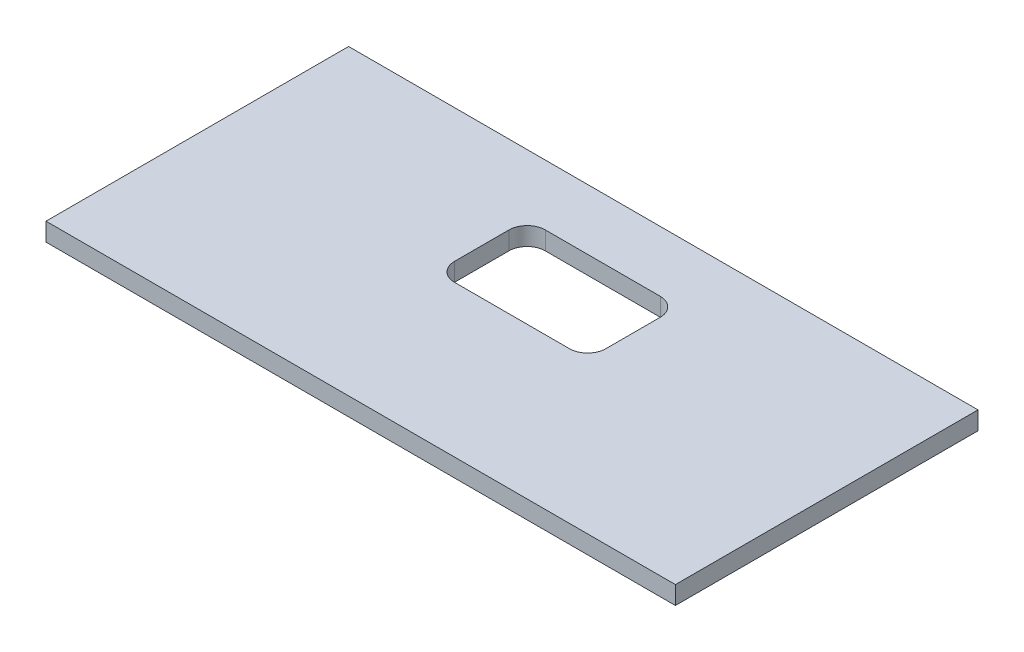
ISO-10303-21;
HEADER;
FILE_DESCRIPTION(('STEP AP214'),'2;1');
FILE_NAME('part.step','',(''),(''),'','','');
FILE_SCHEMA(('AUTOMOTIVE_DESIGN { 1 0 10303 214 1 1 1 1 }'));
ENDSEC;
DATA;
#1=APPLICATION_CONTEXT('core data for automotive mechanical design processes');
#2=APPLICATION_PROTOCOL_DEFINITION('international standard','automotive_design',2000,#1);
#3=PRODUCT_CONTEXT('',#1,'mechanical');
#4=PRODUCT('Part','Part','',(#3));
#5=PRODUCT_RELATED_PRODUCT_CATEGORY('part','',(#4));
#6=PRODUCT_DEFINITION_FORMATION('','',#4);
#7=PRODUCT_DEFINITION_CONTEXT('part definition',#1,'design');
#8=PRODUCT_DEFINITION('design','',#6,#7);
#9=PRODUCT_DEFINITION_SHAPE('','',#8);
#10=(LENGTH_UNIT() NAMED_UNIT(*) SI_UNIT(.MILLI.,.METRE.));
#11=(NAMED_UNIT(*) PLANE_ANGLE_UNIT() SI_UNIT($,.RADIAN.));
#12=(NAMED_UNIT(*) SI_UNIT($,.STERADIAN.) SOLID_ANGLE_UNIT());
#13=UNCERTAINTY_MEASURE_WITH_UNIT(LENGTH_MEASURE(1.E-05),#10,'distance_accuracy_value','');
#14=(GEOMETRIC_REPRESENTATION_CONTEXT(3) GLOBAL_UNCERTAINTY_ASSIGNED_CONTEXT((#13)) GLOBAL_UNIT_ASSIGNED_CONTEXT((#10,
#11,#12)) REPRESENTATION_CONTEXT('',''));
#15=CARTESIAN_POINT('',(0.,0.,0.));
#16=DIRECTION('',(0.,0.,1.));
#17=DIRECTION('',(1.,0.,0.));
#18=AXIS2_PLACEMENT_3D('',#15,#16,#17);
#19=CARTESIAN_POINT('',(0.,3.,0.));
#20=DIRECTION('',(0.,1.,0.));
#21=DIRECTION('',(0.,0.,1.));
#22=AXIS2_PLACEMENT_3D('',#19,#20,#21);
#23=PLANE('',#22);
#24=DIRECTION('',(0.,0.,1.));
#25=VECTOR('',#24,1.);
#26=CARTESIAN_POINT('',(0.,3.,0.));
#27=LINE('',#26,#25);
#28=CARTESIAN_POINT('',(0.,3.,0.));
#29=VERTEX_POINT('',#28);
#30=CARTESIAN_POINT('',(0.,3.,50.));
#31=VERTEX_POINT('',#30);
#32=EDGE_CURVE('E218',#29,#31,#27,.T.);
#33=ORIENTED_EDGE('',*,*,#32,.T.);
#34=DIRECTION('',(1.,0.,0.));
#35=VECTOR('',#34,1.);
#36=CARTESIAN_POINT('',(0.,3.,50.));
#37=LINE('',#36,#35);
#38=CARTESIAN_POINT('',(104.,3.,50.));
#39=VERTEX_POINT('',#38);
#40=EDGE_CURVE('E222',#31,#39,#37,.T.);
#41=ORIENTED_EDGE('',*,*,#40,.T.);
#42=DIRECTION('',(0.,0.,-1.));
#43=VECTOR('',#42,1.);
#44=CARTESIAN_POINT('',(104.,3.,0.));
#45=LINE('',#44,#43);
#46=CARTESIAN_POINT('',(104.,3.,0.));
#47=VERTEX_POINT('',#46);
#48=EDGE_CURVE('E226',#39,#47,#45,.T.);
#49=ORIENTED_EDGE('',*,*,#48,.T.);
#50=DIRECTION('',(-1.,0.,0.));
#51=VECTOR('',#50,1.);
#52=CARTESIAN_POINT('',(0.,3.,0.));
#53=LINE('',#52,#51);
#54=EDGE_CURVE('E229',#47,#29,#53,.T.);
#55=ORIENTED_EDGE('',*,*,#54,.T.);
#56=EDGE_LOOP('',(#33,#41,#49,#55));
#57=FACE_BOUND('',#56,.T.);
#58=DIRECTION('',(-1.,0.,0.));
#59=VECTOR('',#58,1.);
#60=CARTESIAN_POINT('',(42.5,3.,10.));
#61=LINE('',#60,#59);
#62=CARTESIAN_POINT('',(61.5,3.,10.));
#63=VERTEX_POINT('',#62);
#64=CARTESIAN_POINT('',(42.5,3.,10.));
#65=VERTEX_POINT('',#64);
#66=EDGE_CURVE('E138',#63,#65,#61,.T.);
#67=ORIENTED_EDGE('',*,*,#66,.F.);
#68=CARTESIAN_POINT('',(61.5,3.,13.));
#69=DIRECTION('',(0.,1.,0.));
#70=DIRECTION('',(0.,0.,-1.));
#71=AXIS2_PLACEMENT_3D('',#68,#69,#70);
#72=CIRCLE('',#71,3.);
#73=CARTESIAN_POINT('',(64.5,3.,13.));
#74=VERTEX_POINT('',#73);
#75=EDGE_CURVE('E129',#74,#63,#72,.T.);
#76=ORIENTED_EDGE('',*,*,#75,.F.);
#77=DIRECTION('',(0.,0.,-1.));
#78=VECTOR('',#77,1.);
#79=CARTESIAN_POINT('',(64.5,3.,13.));
#80=LINE('',#79,#78);
#81=CARTESIAN_POINT('',(64.5,3.,22.));
#82=VERTEX_POINT('',#81);
#83=EDGE_CURVE('E170',#82,#74,#80,.T.);
#84=ORIENTED_EDGE('',*,*,#83,.F.);
#85=CARTESIAN_POINT('',(61.5,3.,22.));
#86=DIRECTION('',(0.,1.,0.));
#87=DIRECTION('',(0.,0.,1.));
#88=AXIS2_PLACEMENT_3D('',#85,#86,#87);
#89=CIRCLE('',#88,3.);
#90=CARTESIAN_POINT('',(61.5,3.,25.));
#91=VERTEX_POINT('',#90);
#92=EDGE_CURVE('E167',#91,#82,#89,.T.);
#93=ORIENTED_EDGE('',*,*,#92,.F.);
#94=DIRECTION('',(1.,0.,0.));
#95=VECTOR('',#94,1.);
#96=CARTESIAN_POINT('',(42.5,3.,25.));
#97=LINE('',#96,#95);
#98=CARTESIAN_POINT('',(42.5,3.,25.));
#99=VERTEX_POINT('',#98);
#100=EDGE_CURVE('E164',#99,#91,#97,.T.);
#101=ORIENTED_EDGE('',*,*,#100,.F.);
#102=CARTESIAN_POINT('',(42.5,3.,22.));
#103=DIRECTION('',(0.,1.,0.));
#104=DIRECTION('',(0.,0.,1.));
#105=AXIS2_PLACEMENT_3D('',#102,#103,#104);
#106=CIRCLE('',#105,3.);
#107=CARTESIAN_POINT('',(39.5,3.,22.));
#108=VERTEX_POINT('',#107);
#109=EDGE_CURVE('E161',#108,#99,#106,.T.);
#110=ORIENTED_EDGE('',*,*,#109,.F.);
#111=DIRECTION('',(0.,0.,1.));
#112=VECTOR('',#111,1.);
#113=CARTESIAN_POINT('',(39.5,3.,13.));
#114=LINE('',#113,#112);
#115=CARTESIAN_POINT('',(39.5,3.,13.));
#116=VERTEX_POINT('',#115);
#117=EDGE_CURVE('E156',#116,#108,#114,.T.);
#118=ORIENTED_EDGE('',*,*,#117,.F.);
#119=CARTESIAN_POINT('',(42.5,3.,13.));
#120=DIRECTION('',(0.,1.,0.));
#121=DIRECTION('',(0.,0.,1.));
#122=AXIS2_PLACEMENT_3D('',#119,#120,#121);
#123=CIRCLE('',#122,3.);
#124=EDGE_CURVE('E152',#65,#116,#123,.T.);
#125=ORIENTED_EDGE('',*,*,#124,.F.);
#126=EDGE_LOOP('',(#67,#76,#84,#93,#101,#110,#118,#125));
#127=FACE_BOUND('',#126,.T.);
#128=ADVANCED_FACE('F39',(#57,#127),#23,.T.);
#129=CARTESIAN_POINT('',(0.,0.,0.));
#130=DIRECTION('',(0.,1.,0.));
#131=DIRECTION('',(0.,0.,1.));
#132=AXIS2_PLACEMENT_3D('',#129,#130,#131);
#133=PLANE('',#132);
#134=DIRECTION('',(0.,0.,1.));
#135=VECTOR('',#134,1.);
#136=CARTESIAN_POINT('',(0.,0.,0.));
#137=LINE('',#136,#135);
#138=CARTESIAN_POINT('',(0.,0.,0.));
#139=VERTEX_POINT('',#138);
#140=CARTESIAN_POINT('',(0.,0.,50.));
#141=VERTEX_POINT('',#140);
#142=EDGE_CURVE('E147',#139,#141,#137,.T.);
#143=ORIENTED_EDGE('',*,*,#142,.F.);
#144=DIRECTION('',(-1.,0.,0.));
#145=VECTOR('',#144,1.);
#146=CARTESIAN_POINT('',(0.,0.,0.));
#147=LINE('',#146,#145);
#148=CARTESIAN_POINT('',(104.,0.,0.));
#149=VERTEX_POINT('',#148);
#150=EDGE_CURVE('E223',#149,#139,#147,.T.);
#151=ORIENTED_EDGE('',*,*,#150,.F.);
#152=DIRECTION('',(0.,0.,-1.));
#153=VECTOR('',#152,1.);
#154=CARTESIAN_POINT('',(104.,0.,0.));
#155=LINE('',#154,#153);
#156=CARTESIAN_POINT('',(104.,0.,50.));
#157=VERTEX_POINT('',#156);
#158=EDGE_CURVE('E239',#157,#149,#155,.T.);
#159=ORIENTED_EDGE('',*,*,#158,.F.);
#160=DIRECTION('',(1.,0.,0.));
#161=VECTOR('',#160,1.);
#162=CARTESIAN_POINT('',(0.,0.,50.));
#163=LINE('',#162,#161);
#164=EDGE_CURVE('E236',#141,#157,#163,.T.);
#165=ORIENTED_EDGE('',*,*,#164,.F.);
#166=EDGE_LOOP('',(#143,#151,#159,#165));
#167=FACE_BOUND('',#166,.T.);
#168=CARTESIAN_POINT('',(61.5,0.,13.));
#169=DIRECTION('',(0.,1.,0.));
#170=DIRECTION('',(0.,0.,-1.));
#171=AXIS2_PLACEMENT_3D('',#168,#169,#170);
#172=CIRCLE('',#171,3.);
#173=CARTESIAN_POINT('',(64.5,0.,13.));
#174=VERTEX_POINT('',#173);
#175=CARTESIAN_POINT('',(61.5,0.,10.));
#176=VERTEX_POINT('',#175);
#177=EDGE_CURVE('E63',#174,#176,#172,.T.);
#178=ORIENTED_EDGE('',*,*,#177,.T.);
#179=DIRECTION('',(-1.,0.,0.));
#180=VECTOR('',#179,1.);
#181=CARTESIAN_POINT('',(42.5,0.,10.));
#182=LINE('',#181,#180);
#183=CARTESIAN_POINT('',(42.5,0.,10.));
#184=VERTEX_POINT('',#183);
#185=EDGE_CURVE('E145',#176,#184,#182,.T.);
#186=ORIENTED_EDGE('',*,*,#185,.T.);
#187=CARTESIAN_POINT('',(42.5,0.,13.));
#188=DIRECTION('',(0.,1.,0.));
#189=DIRECTION('',(0.,0.,1.));
#190=AXIS2_PLACEMENT_3D('',#187,#188,#189);
#191=CIRCLE('',#190,3.);
#192=CARTESIAN_POINT('',(39.5,0.,13.));
#193=VERTEX_POINT('',#192);
#194=EDGE_CURVE('E177',#184,#193,#191,.T.);
#195=ORIENTED_EDGE('',*,*,#194,.T.);
#196=DIRECTION('',(0.,0.,1.));
#197=VECTOR('',#196,1.);
#198=CARTESIAN_POINT('',(39.5,0.,13.));
#199=LINE('',#198,#197);
#200=CARTESIAN_POINT('',(39.5,0.,22.));
#201=VERTEX_POINT('',#200);
#202=EDGE_CURVE('E181',#193,#201,#199,.T.);
#203=ORIENTED_EDGE('',*,*,#202,.T.);
#204=CARTESIAN_POINT('',(42.5,0.,22.));
#205=DIRECTION('',(0.,1.,0.));
#206=DIRECTION('',(0.,0.,1.));
#207=AXIS2_PLACEMENT_3D('',#204,#205,#206);
#208=CIRCLE('',#207,3.);
#209=CARTESIAN_POINT('',(42.5,0.,25.));
#210=VERTEX_POINT('',#209);
#211=EDGE_CURVE('E185',#201,#210,#208,.T.);
#212=ORIENTED_EDGE('',*,*,#211,.T.);
#213=DIRECTION('',(1.,0.,0.));
#214=VECTOR('',#213,1.);
#215=CARTESIAN_POINT('',(42.5,0.,25.));
#216=LINE('',#215,#214);
#217=CARTESIAN_POINT('',(61.5,0.,25.));
#218=VERTEX_POINT('',#217);
#219=EDGE_CURVE('E189',#210,#218,#216,.T.);
#220=ORIENTED_EDGE('',*,*,#219,.T.);
#221=CARTESIAN_POINT('',(61.5,0.,22.));
#222=DIRECTION('',(0.,1.,0.));
#223=DIRECTION('',(0.,0.,1.));
#224=AXIS2_PLACEMENT_3D('',#221,#222,#223);
#225=CIRCLE('',#224,3.);
#226=CARTESIAN_POINT('',(64.5,0.,22.));
#227=VERTEX_POINT('',#226);
#228=EDGE_CURVE('E193',#218,#227,#225,.T.);
#229=ORIENTED_EDGE('',*,*,#228,.T.);
#230=DIRECTION('',(0.,0.,-1.));
#231=VECTOR('',#230,1.);
#232=CARTESIAN_POINT('',(64.5,0.,13.));
#233=LINE('',#232,#231);
#234=EDGE_CURVE('E139',#227,#174,#233,.T.);
#235=ORIENTED_EDGE('',*,*,#234,.T.);
#236=EDGE_LOOP('',(#178,#186,#195,#203,#212,#220,#229,#235));
#237=FACE_BOUND('',#236,.T.);
#238=ADVANCED_FACE('F262',(#167,#237),#133,.F.);
#239=CARTESIAN_POINT('',(0.,3.,0.));
#240=DIRECTION('',(1.,0.,0.));
#241=DIRECTION('',(0.,0.,-1.));
#242=AXIS2_PLACEMENT_3D('',#239,#240,#241);
#243=PLANE('',#242);
#244=ORIENTED_EDGE('',*,*,#142,.T.);
#245=DIRECTION('',(0.,-1.,0.));
#246=VECTOR('',#245,1.);
#247=CARTESIAN_POINT('',(0.,3.,50.));
#248=LINE('',#247,#246);
#249=EDGE_CURVE('E11',#31,#141,#248,.T.);
#250=ORIENTED_EDGE('',*,*,#249,.F.);
#251=ORIENTED_EDGE('',*,*,#32,.F.);
#252=DIRECTION('',(0.,-1.,0.));
#253=VECTOR('',#252,1.);
#254=CARTESIAN_POINT('',(0.,3.,0.));
#255=LINE('',#254,#253);
#256=EDGE_CURVE('E232',#29,#139,#255,.T.);
#257=ORIENTED_EDGE('',*,*,#256,.T.);
#258=EDGE_LOOP('',(#244,#250,#251,#257));
#259=FACE_BOUND('',#258,.T.);
#260=ADVANCED_FACE('F41',(#259),#243,.F.);
#261=CARTESIAN_POINT('',(0.,3.,50.));
#262=DIRECTION('',(0.,0.,-1.));
#263=DIRECTION('',(-1.,0.,0.));
#264=AXIS2_PLACEMENT_3D('',#261,#262,#263);
#265=PLANE('',#264);
#266=ORIENTED_EDGE('',*,*,#164,.T.);
#267=DIRECTION('',(0.,-1.,0.));
#268=VECTOR('',#267,1.);
#269=CARTESIAN_POINT('',(104.,3.,50.));
#270=LINE('',#269,#268);
#271=EDGE_CURVE('E48',#39,#157,#270,.T.);
#272=ORIENTED_EDGE('',*,*,#271,.F.);
#273=ORIENTED_EDGE('',*,*,#40,.F.);
#274=ORIENTED_EDGE('',*,*,#249,.T.);
#275=EDGE_LOOP('',(#266,#272,#273,#274));
#276=FACE_BOUND('',#275,.T.);
#277=ADVANCED_FACE('F272',(#276),#265,.F.);
#278=CARTESIAN_POINT('',(104.,3.,0.));
#279=DIRECTION('',(-1.,0.,0.));
#280=DIRECTION('',(0.,0.,1.));
#281=AXIS2_PLACEMENT_3D('',#278,#279,#280);
#282=PLANE('',#281);
#283=ORIENTED_EDGE('',*,*,#158,.T.);
#284=DIRECTION('',(0.,-1.,0.));
#285=VECTOR('',#284,1.);
#286=CARTESIAN_POINT('',(104.,3.,0.));
#287=LINE('',#286,#285);
#288=EDGE_CURVE('E247',#47,#149,#287,.T.);
#289=ORIENTED_EDGE('',*,*,#288,.F.);
#290=ORIENTED_EDGE('',*,*,#48,.F.);
#291=ORIENTED_EDGE('',*,*,#271,.T.);
#292=EDGE_LOOP('',(#283,#289,#290,#291));
#293=FACE_BOUND('',#292,.T.);
#294=ADVANCED_FACE('F256',(#293),#282,.F.);
#295=CARTESIAN_POINT('',(0.,3.,0.));
#296=DIRECTION('',(0.,0.,1.));
#297=DIRECTION('',(1.,0.,0.));
#298=AXIS2_PLACEMENT_3D('',#295,#296,#297);
#299=PLANE('',#298);
#300=ORIENTED_EDGE('',*,*,#150,.T.);
#301=ORIENTED_EDGE('',*,*,#256,.F.);
#302=ORIENTED_EDGE('',*,*,#54,.F.);
#303=ORIENTED_EDGE('',*,*,#288,.T.);
#304=EDGE_LOOP('',(#300,#301,#302,#303));
#305=FACE_BOUND('',#304,.T.);
#306=ADVANCED_FACE('F266',(#305),#299,.F.);
#307=CARTESIAN_POINT('',(61.5,3.,13.));
#308=DIRECTION('',(0.,-1.,0.));
#309=DIRECTION('',(0.,0.,-1.));
#310=AXIS2_PLACEMENT_3D('',#307,#308,#309);
#311=CYLINDRICAL_SURFACE('',#310,3.);
#312=ORIENTED_EDGE('',*,*,#177,.F.);
#313=DIRECTION('',(0.,-1.,0.));
#314=VECTOR('',#313,1.);
#315=CARTESIAN_POINT('',(64.5,3.,13.));
#316=LINE('',#315,#314);
#317=EDGE_CURVE('E133',#74,#174,#316,.T.);
#318=ORIENTED_EDGE('',*,*,#317,.F.);
#319=ORIENTED_EDGE('',*,*,#75,.T.);
#320=DIRECTION('',(0.,-1.,0.));
#321=VECTOR('',#320,1.);
#322=CARTESIAN_POINT('',(61.5,3.,10.));
#323=LINE('',#322,#321);
#324=EDGE_CURVE('E132',#63,#176,#323,.T.);
#325=ORIENTED_EDGE('',*,*,#324,.T.);
#326=EDGE_LOOP('',(#312,#318,#319,#325));
#327=FACE_BOUND('',#326,.T.);
#328=ADVANCED_FACE('F131',(#327),#311,.F.);
#329=CARTESIAN_POINT('',(42.5,3.,10.));
#330=DIRECTION('',(0.,0.,1.));
#331=DIRECTION('',(1.,0.,0.));
#332=AXIS2_PLACEMENT_3D('',#329,#330,#331);
#333=PLANE('',#332);
#334=ORIENTED_EDGE('',*,*,#185,.F.);
#335=ORIENTED_EDGE('',*,*,#324,.F.);
#336=ORIENTED_EDGE('',*,*,#66,.T.);
#337=DIRECTION('',(0.,-1.,0.));
#338=VECTOR('',#337,1.);
#339=CARTESIAN_POINT('',(42.5,3.,10.));
#340=LINE('',#339,#338);
#341=EDGE_CURVE('E148',#65,#184,#340,.T.);
#342=ORIENTED_EDGE('',*,*,#341,.T.);
#343=EDGE_LOOP('',(#334,#335,#336,#342));
#344=FACE_BOUND('',#343,.T.);
#345=ADVANCED_FACE('F142',(#344),#333,.T.);
#346=CARTESIAN_POINT('',(42.5,3.,13.));
#347=DIRECTION('',(0.,-1.,0.));
#348=DIRECTION('',(0.,0.,-1.));
#349=AXIS2_PLACEMENT_3D('',#346,#347,#348);
#350=CYLINDRICAL_SURFACE('',#349,3.);
#351=ORIENTED_EDGE('',*,*,#194,.F.);
#352=ORIENTED_EDGE('',*,*,#341,.F.);
#353=ORIENTED_EDGE('',*,*,#124,.T.);
#354=DIRECTION('',(0.,-1.,0.));
#355=VECTOR('',#354,1.);
#356=CARTESIAN_POINT('',(39.5,3.,13.));
#357=LINE('',#356,#355);
#358=EDGE_CURVE('E213',#116,#193,#357,.T.);
#359=ORIENTED_EDGE('',*,*,#358,.T.);
#360=EDGE_LOOP('',(#351,#352,#353,#359));
#361=FACE_BOUND('',#360,.T.);
#362=ADVANCED_FACE('F295',(#361),#350,.F.);
#363=CARTESIAN_POINT('',(39.5,3.,13.));
#364=DIRECTION('',(1.,0.,0.));
#365=DIRECTION('',(0.,0.,-1.));
#366=AXIS2_PLACEMENT_3D('',#363,#364,#365);
#367=PLANE('',#366);
#368=ORIENTED_EDGE('',*,*,#202,.F.);
#369=ORIENTED_EDGE('',*,*,#358,.F.);
#370=ORIENTED_EDGE('',*,*,#117,.T.);
#371=DIRECTION('',(0.,-1.,0.));
#372=VECTOR('',#371,1.);
#373=CARTESIAN_POINT('',(39.5,3.,22.));
#374=LINE('',#373,#372);
#375=EDGE_CURVE('E210',#108,#201,#374,.T.);
#376=ORIENTED_EDGE('',*,*,#375,.T.);
#377=EDGE_LOOP('',(#368,#369,#370,#376));
#378=FACE_BOUND('',#377,.T.);
#379=ADVANCED_FACE('F299',(#378),#367,.T.);
#380=CARTESIAN_POINT('',(42.5,3.,22.));
#381=DIRECTION('',(0.,-1.,0.));
#382=DIRECTION('',(0.,0.,-1.));
#383=AXIS2_PLACEMENT_3D('',#380,#381,#382);
#384=CYLINDRICAL_SURFACE('',#383,3.);
#385=ORIENTED_EDGE('',*,*,#211,.F.);
#386=ORIENTED_EDGE('',*,*,#375,.F.);
#387=ORIENTED_EDGE('',*,*,#109,.T.);
#388=DIRECTION('',(0.,-1.,0.));
#389=VECTOR('',#388,1.);
#390=CARTESIAN_POINT('',(42.5,3.,25.));
#391=LINE('',#390,#389);
#392=EDGE_CURVE('E207',#99,#210,#391,.T.);
#393=ORIENTED_EDGE('',*,*,#392,.T.);
#394=EDGE_LOOP('',(#385,#386,#387,#393));
#395=FACE_BOUND('',#394,.T.);
#396=ADVANCED_FACE('F305',(#395),#384,.F.);
#397=CARTESIAN_POINT('',(42.5,3.,25.));
#398=DIRECTION('',(0.,0.,-1.));
#399=DIRECTION('',(-1.,0.,0.));
#400=AXIS2_PLACEMENT_3D('',#397,#398,#399);
#401=PLANE('',#400);
#402=ORIENTED_EDGE('',*,*,#219,.F.);
#403=ORIENTED_EDGE('',*,*,#392,.F.);
#404=ORIENTED_EDGE('',*,*,#100,.T.);
#405=DIRECTION('',(0.,-1.,0.));
#406=VECTOR('',#405,1.);
#407=CARTESIAN_POINT('',(61.5,3.,25.));
#408=LINE('',#407,#406);
#409=EDGE_CURVE('E204',#91,#218,#408,.T.);
#410=ORIENTED_EDGE('',*,*,#409,.T.);
#411=EDGE_LOOP('',(#402,#403,#404,#410));
#412=FACE_BOUND('',#411,.T.);
#413=ADVANCED_FACE('F309',(#412),#401,.T.);
#414=CARTESIAN_POINT('',(61.5,3.,22.));
#415=DIRECTION('',(0.,-1.,0.));
#416=DIRECTION('',(0.,0.,-1.));
#417=AXIS2_PLACEMENT_3D('',#414,#415,#416);
#418=CYLINDRICAL_SURFACE('',#417,3.);
#419=ORIENTED_EDGE('',*,*,#228,.F.);
#420=ORIENTED_EDGE('',*,*,#409,.F.);
#421=ORIENTED_EDGE('',*,*,#92,.T.);
#422=DIRECTION('',(0.,-1.,0.));
#423=VECTOR('',#422,1.);
#424=CARTESIAN_POINT('',(64.5,3.,22.));
#425=LINE('',#424,#423);
#426=EDGE_CURVE('E55',#82,#227,#425,.T.);
#427=ORIENTED_EDGE('',*,*,#426,.T.);
#428=EDGE_LOOP('',(#419,#420,#421,#427));
#429=FACE_BOUND('',#428,.T.);
#430=ADVANCED_FACE('F313',(#429),#418,.F.);
#431=CARTESIAN_POINT('',(64.5,3.,13.));
#432=DIRECTION('',(-1.,0.,0.));
#433=DIRECTION('',(0.,0.,1.));
#434=AXIS2_PLACEMENT_3D('',#431,#432,#433);
#435=PLANE('',#434);
#436=ORIENTED_EDGE('',*,*,#234,.F.);
#437=ORIENTED_EDGE('',*,*,#426,.F.);
#438=ORIENTED_EDGE('',*,*,#83,.T.);
#439=ORIENTED_EDGE('',*,*,#317,.T.);
#440=EDGE_LOOP('',(#436,#437,#438,#439));
#441=FACE_BOUND('',#440,.T.);
#442=ADVANCED_FACE('F317',(#441),#435,.T.);
#443=CLOSED_SHELL('',(#128,#238,#260,#277,#294,#306,#328,#345,#362,#379,#396,#413,#430,#442));
#444=MANIFOLD_SOLID_BREP('B2',#443);
#445=ADVANCED_BREP_SHAPE_REPRESENTATION('',(#18,#444),#14);
#446=SHAPE_DEFINITION_REPRESENTATION(#9,#445);
ENDSEC;
END-ISO-10303-21;
